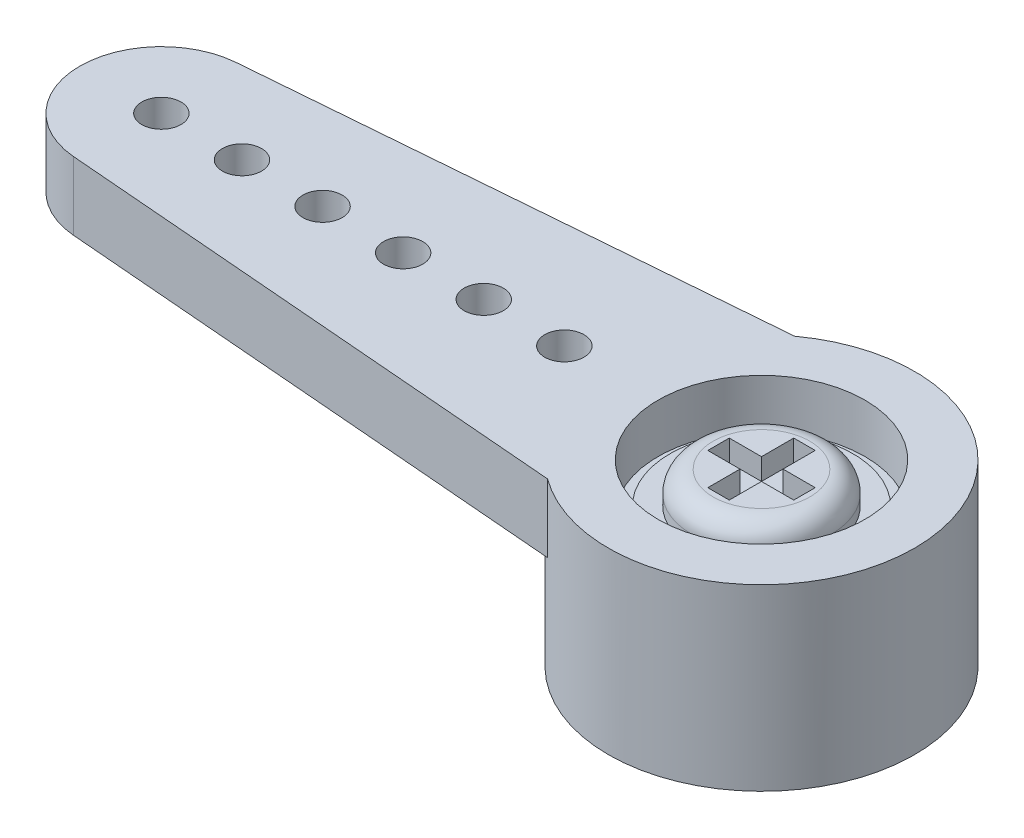
ISO-10303-21;
HEADER;
FILE_DESCRIPTION(('STEP AP214'),'2;1');
FILE_NAME('part.step','',(''),(''),'','','');
FILE_SCHEMA(('AUTOMOTIVE_DESIGN { 1 0 10303 214 1 1 1 1 }'));
ENDSEC;
DATA;
#1=APPLICATION_CONTEXT('core data for automotive mechanical design processes');
#2=APPLICATION_PROTOCOL_DEFINITION('international standard','automotive_design',2000,#1);
#3=PRODUCT_CONTEXT('',#1,'mechanical');
#4=PRODUCT('Part','Part','',(#3));
#5=PRODUCT_RELATED_PRODUCT_CATEGORY('part','',(#4));
#6=PRODUCT_DEFINITION_FORMATION('','',#4);
#7=PRODUCT_DEFINITION_CONTEXT('part definition',#1,'design');
#8=PRODUCT_DEFINITION('design','',#6,#7);
#9=PRODUCT_DEFINITION_SHAPE('','',#8);
#10=(LENGTH_UNIT() NAMED_UNIT(*) SI_UNIT(.MILLI.,.METRE.));
#11=(NAMED_UNIT(*) PLANE_ANGLE_UNIT() SI_UNIT($,.RADIAN.));
#12=(NAMED_UNIT(*) SI_UNIT($,.STERADIAN.) SOLID_ANGLE_UNIT());
#13=UNCERTAINTY_MEASURE_WITH_UNIT(LENGTH_MEASURE(1.E-05),#10,'distance_accuracy_value','');
#14=(GEOMETRIC_REPRESENTATION_CONTEXT(3) GLOBAL_UNCERTAINTY_ASSIGNED_CONTEXT((#13)) GLOBAL_UNIT_ASSIGNED_CONTEXT((#10,
#11,#12)) REPRESENTATION_CONTEXT('',''));
#15=CARTESIAN_POINT('',(0.,0.,0.));
#16=DIRECTION('',(0.,0.,1.));
#17=DIRECTION('',(1.,0.,0.));
#18=AXIS2_PLACEMENT_3D('',#15,#16,#17);
#19=CARTESIAN_POINT('',(0.,0.6604,0.));
#20=DIRECTION('',(0.,1.,0.));
#21=DIRECTION('',(0.,0.,1.));
#22=AXIS2_PLACEMENT_3D('',#19,#20,#21);
#23=PLANE('',#22);
#24=CARTESIAN_POINT('',(0.,0.6604,0.));
#25=DIRECTION('',(0.,1.,0.));
#26=DIRECTION('',(0.,0.,1.));
#27=AXIS2_PLACEMENT_3D('',#24,#25,#26);
#28=CIRCLE('',#27,2.159);
#29=CARTESIAN_POINT('',(0.,0.6604,2.159));
#30=VERTEX_POINT('',#29);
#31=EDGE_CURVE('E265',#30,#30,#28,.T.);
#32=ORIENTED_EDGE('',*,*,#31,.T.);
#33=EDGE_LOOP('',(#32));
#34=FACE_BOUND('',#33,.T.);
#35=CARTESIAN_POINT('',(0.,0.6604,0.));
#36=DIRECTION('',(0.,1.,0.));
#37=DIRECTION('',(0.,0.,1.));
#38=AXIS2_PLACEMENT_3D('',#35,#36,#37);
#39=CIRCLE('',#38,1.651);
#40=CARTESIAN_POINT('',(0.,0.6604,-1.651));
#41=VERTEX_POINT('',#40);
#42=EDGE_CURVE('E242',#41,#41,#39,.T.);
#43=ORIENTED_EDGE('',*,*,#42,.F.);
#44=EDGE_LOOP('',(#43));
#45=FACE_BOUND('',#44,.T.);
#46=ADVANCED_FACE('F35',(#34,#45),#23,.T.);
#47=CARTESIAN_POINT('',(0.,0.4572,0.));
#48=DIRECTION('',(0.,1.,0.));
#49=DIRECTION('',(0.,0.,1.));
#50=AXIS2_PLACEMENT_3D('',#47,#48,#49);
#51=PLANE('',#50);
#52=CARTESIAN_POINT('',(0.,0.4572,0.));
#53=DIRECTION('',(0.,1.,0.));
#54=DIRECTION('',(0.,0.,1.));
#55=AXIS2_PLACEMENT_3D('',#52,#53,#54);
#56=CIRCLE('',#55,2.44475);
#57=CARTESIAN_POINT('',(0.,0.4572,2.44475));
#58=VERTEX_POINT('',#57);
#59=EDGE_CURVE('E277',#58,#58,#56,.T.);
#60=ORIENTED_EDGE('',*,*,#59,.T.);
#61=EDGE_LOOP('',(#60));
#62=FACE_BOUND('',#61,.T.);
#63=CARTESIAN_POINT('',(0.,0.4572,0.));
#64=DIRECTION('',(0.,1.,0.));
#65=DIRECTION('',(0.,0.,1.));
#66=AXIS2_PLACEMENT_3D('',#63,#64,#65);
#67=CIRCLE('',#66,2.159);
#68=CARTESIAN_POINT('',(0.,0.4572,2.159));
#69=VERTEX_POINT('',#68);
#70=EDGE_CURVE('E264',#69,#69,#67,.T.);
#71=ORIENTED_EDGE('',*,*,#70,.F.);
#72=EDGE_LOOP('',(#71));
#73=FACE_BOUND('',#72,.T.);
#74=ADVANCED_FACE('F363',(#62,#73),#51,.T.);
#75=CARTESIAN_POINT('',(0.,-2.6162,0.));
#76=DIRECTION('',(0.,1.,0.));
#77=DIRECTION('',(0.,0.,1.));
#78=AXIS2_PLACEMENT_3D('',#75,#76,#77);
#79=CYLINDRICAL_SURFACE('',#78,1.27);
#80=CARTESIAN_POINT('',(0.,0.4572,0.));
#81=DIRECTION('',(0.,1.,0.));
#82=DIRECTION('',(0.,0.,1.));
#83=AXIS2_PLACEMENT_3D('',#80,#81,#82);
#84=CIRCLE('',#83,1.27);
#85=CARTESIAN_POINT('',(0.,0.4572,1.27));
#86=VERTEX_POINT('',#85);
#87=EDGE_CURVE('E280',#86,#86,#84,.F.);
#88=ORIENTED_EDGE('',*,*,#87,.F.);
#89=EDGE_LOOP('',(#88));
#90=FACE_BOUND('',#89,.T.);
#91=CARTESIAN_POINT('',(0.,-0.2794,0.));
#92=DIRECTION('',(0.,-1.,0.));
#93=DIRECTION('',(0.,0.,-1.));
#94=AXIS2_PLACEMENT_3D('',#91,#92,#93);
#95=CIRCLE('',#94,1.27);
#96=CARTESIAN_POINT('',(0.,-0.2794,-1.27));
#97=VERTEX_POINT('',#96);
#98=EDGE_CURVE('E274',#97,#97,#95,.F.);
#99=ORIENTED_EDGE('',*,*,#98,.F.);
#100=EDGE_LOOP('',(#99));
#101=FACE_BOUND('',#100,.T.);
#102=ADVANCED_FACE('F369',(#90,#101),#79,.F.);
#103=CARTESIAN_POINT('',(0.,1.6129,0.));
#104=DIRECTION('',(0.,-1.,0.));
#105=DIRECTION('',(0.,0.,-1.));
#106=AXIS2_PLACEMENT_3D('',#103,#104,#105);
#107=CYLINDRICAL_SURFACE('',#106,3.6195);
#108=DIRECTION('',(0.,-1.,0.));
#109=VECTOR('',#108,1.);
#110=CARTESIAN_POINT('',(-2.13741415032277,1.6129,2.921));
#111=LINE('',#110,#109);
#112=CARTESIAN_POINT('',(-2.13741415032277,1.6129,2.921));
#113=VERTEX_POINT('',#112);
#114=CARTESIAN_POINT('',(-2.13741415032277,0.,2.921));
#115=VERTEX_POINT('',#114);
#116=EDGE_CURVE('E319',#113,#115,#111,.T.);
#117=ORIENTED_EDGE('',*,*,#116,.T.);
#118=CARTESIAN_POINT('',(0.,0.,0.));
#119=DIRECTION('',(0.,1.,0.));
#120=DIRECTION('',(0.,0.,1.));
#121=AXIS2_PLACEMENT_3D('',#118,#119,#120);
#122=CIRCLE('',#121,3.6195);
#123=CARTESIAN_POINT('',(-2.13741415032277,0.,-2.921));
#124=VERTEX_POINT('',#123);
#125=EDGE_CURVE('E332',#124,#115,#122,.T.);
#126=ORIENTED_EDGE('',*,*,#125,.F.);
#127=DIRECTION('',(0.,-1.,0.));
#128=VECTOR('',#127,1.);
#129=CARTESIAN_POINT('',(-2.13741415032277,1.6129,-2.921));
#130=LINE('',#129,#128);
#131=CARTESIAN_POINT('',(-2.13741415032277,1.6129,-2.921));
#132=VERTEX_POINT('',#131);
#133=EDGE_CURVE('E330',#132,#124,#130,.T.);
#134=ORIENTED_EDGE('',*,*,#133,.F.);
#135=CARTESIAN_POINT('',(0.,1.6129,0.));
#136=DIRECTION('',(0.,1.,0.));
#137=DIRECTION('',(0.,0.,1.));
#138=AXIS2_PLACEMENT_3D('',#135,#136,#137);
#139=CIRCLE('',#138,3.6195);
#140=EDGE_CURVE('E312',#113,#132,#139,.T.);
#141=ORIENTED_EDGE('',*,*,#140,.F.);
#142=EDGE_LOOP('',(#117,#126,#134,#141));
#143=FACE_BOUND('',#142,.T.);
#144=CARTESIAN_POINT('',(0.,-2.6162,0.));
#145=DIRECTION('',(0.,1.,0.));
#146=DIRECTION('',(0.,0.,1.));
#147=AXIS2_PLACEMENT_3D('',#144,#145,#146);
#148=CIRCLE('',#147,3.6195);
#149=CARTESIAN_POINT('',(0.,-2.6162,3.6195));
#150=VERTEX_POINT('',#149);
#151=EDGE_CURVE('E308',#150,#150,#148,.T.);
#152=ORIENTED_EDGE('',*,*,#151,.T.);
#153=EDGE_LOOP('',(#152));
#154=FACE_BOUND('',#153,.T.);
#155=ADVANCED_FACE('F420',(#143,#154),#107,.T.);
#156=CARTESIAN_POINT('',(-14.3430596900559,1.6129,-1.92399194172469));
#157=DIRECTION('',(0.0814130180562945,0.,0.996680450541178));
#158=DIRECTION('',(0.996680450541178,0.,-0.0814130180562945));
#159=AXIS2_PLACEMENT_3D('',#156,#157,#158);
#160=PLANE('',#159);
#161=DIRECTION('',(-0.996680450541178,0.,0.0814130180562945));
#162=VECTOR('',#161,1.);
#163=CARTESIAN_POINT('',(-14.3430596900559,0.,-1.92399194172469));
#164=LINE('',#163,#162);
#165=CARTESIAN_POINT('',(-14.3430596900559,0.,-1.92399194172469));
#166=VERTEX_POINT('',#165);
#167=EDGE_CURVE('E311',#124,#166,#164,.T.);
#168=ORIENTED_EDGE('',*,*,#167,.T.);
#169=DIRECTION('',(0.,-1.,0.));
#170=VECTOR('',#169,1.);
#171=CARTESIAN_POINT('',(-14.3430596900559,1.6129,-1.92399194172469));
#172=LINE('',#171,#170);
#173=CARTESIAN_POINT('',(-14.3430596900559,1.6129,-1.92399194172469));
#174=VERTEX_POINT('',#173);
#175=EDGE_CURVE('E328',#174,#166,#172,.T.);
#176=ORIENTED_EDGE('',*,*,#175,.F.);
#177=DIRECTION('',(-0.996680450541178,0.,0.0814130180562945));
#178=VECTOR('',#177,1.);
#179=CARTESIAN_POINT('',(-14.3430596900559,1.6129,-1.92399194172469));
#180=LINE('',#179,#178);
#181=EDGE_CURVE('E86',#132,#174,#180,.T.);
#182=ORIENTED_EDGE('',*,*,#181,.F.);
#183=ORIENTED_EDGE('',*,*,#133,.T.);
#184=EDGE_LOOP('',(#168,#176,#182,#183));
#185=FACE_BOUND('',#184,.T.);
#186=ADVANCED_FACE('F444',(#185),#160,.F.);
#187=CARTESIAN_POINT('',(-14.1859,1.6129,0.));
#188=DIRECTION('',(0.,-1.,0.));
#189=DIRECTION('',(0.,0.,-1.));
#190=AXIS2_PLACEMENT_3D('',#187,#188,#189);
#191=CYLINDRICAL_SURFACE('',#190,1.9304);
#192=CARTESIAN_POINT('',(-14.1859,0.,0.));
#193=DIRECTION('',(0.,1.,0.));
#194=DIRECTION('',(0.,0.,1.));
#195=AXIS2_PLACEMENT_3D('',#192,#193,#194);
#196=CIRCLE('',#195,1.9304);
#197=CARTESIAN_POINT('',(-14.3430596900559,0.,1.92399194172469));
#198=VERTEX_POINT('',#197);
#199=EDGE_CURVE('E78',#166,#198,#196,.T.);
#200=ORIENTED_EDGE('',*,*,#199,.T.);
#201=DIRECTION('',(0.,-1.,0.));
#202=VECTOR('',#201,1.);
#203=CARTESIAN_POINT('',(-14.3430596900559,1.6129,1.92399194172469));
#204=LINE('',#203,#202);
#205=CARTESIAN_POINT('',(-14.3430596900559,1.6129,1.92399194172469));
#206=VERTEX_POINT('',#205);
#207=EDGE_CURVE('E326',#206,#198,#204,.T.);
#208=ORIENTED_EDGE('',*,*,#207,.F.);
#209=CARTESIAN_POINT('',(-14.1859,1.6129,0.));
#210=DIRECTION('',(0.,1.,0.));
#211=DIRECTION('',(0.,0.,1.));
#212=AXIS2_PLACEMENT_3D('',#209,#210,#211);
#213=CIRCLE('',#212,1.9304);
#214=EDGE_CURVE('E316',#174,#206,#213,.T.);
#215=ORIENTED_EDGE('',*,*,#214,.F.);
#216=ORIENTED_EDGE('',*,*,#175,.T.);
#217=EDGE_LOOP('',(#200,#208,#215,#216));
#218=FACE_BOUND('',#217,.T.);
#219=ADVANCED_FACE('F440',(#218),#191,.T.);
#220=CARTESIAN_POINT('',(-14.3430596900559,1.6129,1.92399194172469));
#221=DIRECTION('',(0.0814130180562943,0.,-0.996680450541178));
#222=DIRECTION('',(-0.996680450541178,0.,-0.0814130180562943));
#223=AXIS2_PLACEMENT_3D('',#220,#221,#222);
#224=PLANE('',#223);
#225=DIRECTION('',(0.996680450541178,0.,0.0814130180562943));
#226=VECTOR('',#225,1.);
#227=CARTESIAN_POINT('',(-14.3430596900559,0.,1.92399194172469));
#228=LINE('',#227,#226);
#229=EDGE_CURVE('E314',#198,#115,#228,.T.);
#230=ORIENTED_EDGE('',*,*,#229,.T.);
#231=ORIENTED_EDGE('',*,*,#116,.F.);
#232=DIRECTION('',(0.996680450541178,0.,0.0814130180562943));
#233=VECTOR('',#232,1.);
#234=CARTESIAN_POINT('',(-14.3430596900559,1.6129,1.92399194172469));
#235=LINE('',#234,#233);
#236=EDGE_CURVE('E59',#206,#113,#235,.T.);
#237=ORIENTED_EDGE('',*,*,#236,.F.);
#238=ORIENTED_EDGE('',*,*,#207,.T.);
#239=EDGE_LOOP('',(#230,#231,#237,#238));
#240=FACE_BOUND('',#239,.T.);
#241=ADVANCED_FACE('F433',(#240),#224,.F.);
#242=CARTESIAN_POINT('',(0.,1.6129,0.));
#243=DIRECTION('',(0.,1.,0.));
#244=DIRECTION('',(0.,0.,1.));
#245=AXIS2_PLACEMENT_3D('',#242,#243,#244);
#246=PLANE('',#245);
#247=CARTESIAN_POINT('',(0.,1.6129,0.));
#248=DIRECTION('',(0.,1.,0.));
#249=DIRECTION('',(0.,0.,1.));
#250=AXIS2_PLACEMENT_3D('',#247,#248,#249);
#251=CIRCLE('',#250,2.44475);
#252=CARTESIAN_POINT('',(0.,1.6129,2.44475));
#253=VERTEX_POINT('',#252);
#254=EDGE_CURVE('E281',#253,#253,#251,.T.);
#255=ORIENTED_EDGE('',*,*,#254,.F.);
#256=EDGE_LOOP('',(#255));
#257=FACE_BOUND('',#256,.T.);
#258=CARTESIAN_POINT('',(-12.2809,1.6129,0.));
#259=DIRECTION('',(0.,1.,0.));
#260=DIRECTION('',(0.,0.,1.));
#261=AXIS2_PLACEMENT_3D('',#258,#259,#260);
#262=CIRCLE('',#261,0.46355);
#263=CARTESIAN_POINT('',(-12.2809,1.6129,0.46355));
#264=VERTEX_POINT('',#263);
#265=EDGE_CURVE('E284',#264,#264,#262,.T.);
#266=ORIENTED_EDGE('',*,*,#265,.F.);
#267=EDGE_LOOP('',(#266));
#268=FACE_BOUND('',#267,.T.);
#269=CARTESIAN_POINT('',(-10.3759,1.6129,0.));
#270=DIRECTION('',(0.,1.,0.));
#271=DIRECTION('',(0.,0.,1.));
#272=AXIS2_PLACEMENT_3D('',#269,#270,#271);
#273=CIRCLE('',#272,0.46355);
#274=CARTESIAN_POINT('',(-10.3759,1.6129,0.46355));
#275=VERTEX_POINT('',#274);
#276=EDGE_CURVE('E288',#275,#275,#273,.T.);
#277=ORIENTED_EDGE('',*,*,#276,.F.);
#278=EDGE_LOOP('',(#277));
#279=FACE_BOUND('',#278,.T.);
#280=CARTESIAN_POINT('',(-8.4709,1.6129,0.));
#281=DIRECTION('',(0.,1.,0.));
#282=DIRECTION('',(0.,0.,1.));
#283=AXIS2_PLACEMENT_3D('',#280,#281,#282);
#284=CIRCLE('',#283,0.46355);
#285=CARTESIAN_POINT('',(-8.4709,1.6129,0.46355));
#286=VERTEX_POINT('',#285);
#287=EDGE_CURVE('E292',#286,#286,#284,.T.);
#288=ORIENTED_EDGE('',*,*,#287,.F.);
#289=EDGE_LOOP('',(#288));
#290=FACE_BOUND('',#289,.T.);
#291=CARTESIAN_POINT('',(-6.5659,1.6129,0.));
#292=DIRECTION('',(0.,1.,0.));
#293=DIRECTION('',(0.,0.,1.));
#294=AXIS2_PLACEMENT_3D('',#291,#292,#293);
#295=CIRCLE('',#294,0.46355);
#296=CARTESIAN_POINT('',(-6.5659,1.6129,0.46355));
#297=VERTEX_POINT('',#296);
#298=EDGE_CURVE('E296',#297,#297,#295,.T.);
#299=ORIENTED_EDGE('',*,*,#298,.F.);
#300=EDGE_LOOP('',(#299));
#301=FACE_BOUND('',#300,.T.);
#302=CARTESIAN_POINT('',(-4.6609,1.6129,0.));
#303=DIRECTION('',(0.,1.,0.));
#304=DIRECTION('',(0.,0.,1.));
#305=AXIS2_PLACEMENT_3D('',#302,#303,#304);
#306=CIRCLE('',#305,0.46355);
#307=CARTESIAN_POINT('',(-4.6609,1.6129,0.46355));
#308=VERTEX_POINT('',#307);
#309=EDGE_CURVE('E300',#308,#308,#306,.T.);
#310=ORIENTED_EDGE('',*,*,#309,.F.);
#311=EDGE_LOOP('',(#310));
#312=FACE_BOUND('',#311,.T.);
#313=CARTESIAN_POINT('',(-14.1859,1.6129,0.));
#314=DIRECTION('',(0.,1.,0.));
#315=DIRECTION('',(0.,0.,1.));
#316=AXIS2_PLACEMENT_3D('',#313,#314,#315);
#317=CIRCLE('',#316,0.46355);
#318=CARTESIAN_POINT('',(-14.1859,1.6129,0.463550000000002));
#319=VERTEX_POINT('',#318);
#320=EDGE_CURVE('E304',#319,#319,#317,.T.);
#321=ORIENTED_EDGE('',*,*,#320,.F.);
#322=EDGE_LOOP('',(#321));
#323=FACE_BOUND('',#322,.T.);
#324=ORIENTED_EDGE('',*,*,#236,.T.);
#325=ORIENTED_EDGE('',*,*,#140,.T.);
#326=ORIENTED_EDGE('',*,*,#181,.T.);
#327=ORIENTED_EDGE('',*,*,#214,.T.);
#328=EDGE_LOOP('',(#324,#325,#326,#327));
#329=FACE_BOUND('',#328,.T.);
#330=ADVANCED_FACE('F430',(#257,#268,#279,#290,#301,#312,#323,#329),#246,.T.);
#331=CARTESIAN_POINT('',(0.,0.,0.));
#332=DIRECTION('',(0.,1.,0.));
#333=DIRECTION('',(0.,0.,1.));
#334=AXIS2_PLACEMENT_3D('',#331,#332,#333);
#335=PLANE('',#334);
#336=CARTESIAN_POINT('',(-12.2809,0.,0.));
#337=DIRECTION('',(0.,1.,0.));
#338=DIRECTION('',(0.,0.,1.));
#339=AXIS2_PLACEMENT_3D('',#336,#337,#338);
#340=CIRCLE('',#339,0.46355);
#341=CARTESIAN_POINT('',(-12.2809,0.,0.46355));
#342=VERTEX_POINT('',#341);
#343=EDGE_CURVE('E287',#342,#342,#340,.T.);
#344=ORIENTED_EDGE('',*,*,#343,.T.);
#345=EDGE_LOOP('',(#344));
#346=FACE_BOUND('',#345,.T.);
#347=CARTESIAN_POINT('',(-10.3759,0.,0.));
#348=DIRECTION('',(0.,1.,0.));
#349=DIRECTION('',(0.,0.,1.));
#350=AXIS2_PLACEMENT_3D('',#347,#348,#349);
#351=CIRCLE('',#350,0.46355);
#352=CARTESIAN_POINT('',(-10.3759,0.,0.46355));
#353=VERTEX_POINT('',#352);
#354=EDGE_CURVE('E291',#353,#353,#351,.T.);
#355=ORIENTED_EDGE('',*,*,#354,.T.);
#356=EDGE_LOOP('',(#355));
#357=FACE_BOUND('',#356,.T.);
#358=CARTESIAN_POINT('',(-8.4709,0.,0.));
#359=DIRECTION('',(0.,1.,0.));
#360=DIRECTION('',(0.,0.,1.));
#361=AXIS2_PLACEMENT_3D('',#358,#359,#360);
#362=CIRCLE('',#361,0.46355);
#363=CARTESIAN_POINT('',(-8.4709,0.,0.46355));
#364=VERTEX_POINT('',#363);
#365=EDGE_CURVE('E295',#364,#364,#362,.T.);
#366=ORIENTED_EDGE('',*,*,#365,.T.);
#367=EDGE_LOOP('',(#366));
#368=FACE_BOUND('',#367,.T.);
#369=CARTESIAN_POINT('',(-6.5659,0.,0.));
#370=DIRECTION('',(0.,1.,0.));
#371=DIRECTION('',(0.,0.,1.));
#372=AXIS2_PLACEMENT_3D('',#369,#370,#371);
#373=CIRCLE('',#372,0.46355);
#374=CARTESIAN_POINT('',(-6.5659,0.,0.46355));
#375=VERTEX_POINT('',#374);
#376=EDGE_CURVE('E299',#375,#375,#373,.T.);
#377=ORIENTED_EDGE('',*,*,#376,.T.);
#378=EDGE_LOOP('',(#377));
#379=FACE_BOUND('',#378,.T.);
#380=CARTESIAN_POINT('',(-4.6609,0.,0.));
#381=DIRECTION('',(0.,1.,0.));
#382=DIRECTION('',(0.,0.,1.));
#383=AXIS2_PLACEMENT_3D('',#380,#381,#382);
#384=CIRCLE('',#383,0.46355);
#385=CARTESIAN_POINT('',(-4.6609,0.,0.46355));
#386=VERTEX_POINT('',#385);
#387=EDGE_CURVE('E303',#386,#386,#384,.T.);
#388=ORIENTED_EDGE('',*,*,#387,.T.);
#389=EDGE_LOOP('',(#388));
#390=FACE_BOUND('',#389,.T.);
#391=CARTESIAN_POINT('',(-14.1859,0.,0.));
#392=DIRECTION('',(0.,1.,0.));
#393=DIRECTION('',(0.,0.,1.));
#394=AXIS2_PLACEMENT_3D('',#391,#392,#393);
#395=CIRCLE('',#394,0.46355);
#396=CARTESIAN_POINT('',(-14.1859,0.,0.463550000000002));
#397=VERTEX_POINT('',#396);
#398=EDGE_CURVE('E307',#397,#397,#395,.T.);
#399=ORIENTED_EDGE('',*,*,#398,.T.);
#400=EDGE_LOOP('',(#399));
#401=FACE_BOUND('',#400,.T.);
#402=ORIENTED_EDGE('',*,*,#167,.F.);
#403=ORIENTED_EDGE('',*,*,#125,.T.);
#404=ORIENTED_EDGE('',*,*,#229,.F.);
#405=ORIENTED_EDGE('',*,*,#199,.F.);
#406=EDGE_LOOP('',(#402,#403,#404,#405));
#407=FACE_BOUND('',#406,.T.);
#408=ADVANCED_FACE('F428',(#346,#357,#368,#379,#390,#401,#407),#335,.F.);
#409=CARTESIAN_POINT('',(0.,-2.6162,0.));
#410=DIRECTION('',(0.,1.,0.));
#411=DIRECTION('',(0.,0.,1.));
#412=AXIS2_PLACEMENT_3D('',#409,#410,#411);
#413=PLANE('',#412);
#414=CARTESIAN_POINT('',(0.,-2.6162,0.));
#415=DIRECTION('',(0.,-1.,0.));
#416=DIRECTION('',(0.,0.,-1.));
#417=AXIS2_PLACEMENT_3D('',#414,#415,#416);
#418=CIRCLE('',#417,2.286);
#419=CARTESIAN_POINT('',(0.,-2.6162,-2.286));
#420=VERTEX_POINT('',#419);
#421=EDGE_CURVE('E268',#420,#420,#418,.T.);
#422=ORIENTED_EDGE('',*,*,#421,.F.);
#423=EDGE_LOOP('',(#422));
#424=FACE_BOUND('',#423,.T.);
#425=ORIENTED_EDGE('',*,*,#151,.F.);
#426=EDGE_LOOP('',(#425));
#427=FACE_BOUND('',#426,.T.);
#428=ADVANCED_FACE('F424',(#424,#427),#413,.F.);
#429=CARTESIAN_POINT('',(-14.1859,-2.6162,0.));
#430=DIRECTION('',(0.,1.,0.));
#431=DIRECTION('',(0.,0.,1.));
#432=AXIS2_PLACEMENT_3D('',#429,#430,#431);
#433=CYLINDRICAL_SURFACE('',#432,0.46355);
#434=ORIENTED_EDGE('',*,*,#320,.T.);
#435=EDGE_LOOP('',(#434));
#436=FACE_BOUND('',#435,.T.);
#437=ORIENTED_EDGE('',*,*,#398,.F.);
#438=EDGE_LOOP('',(#437));
#439=FACE_BOUND('',#438,.T.);
#440=ADVANCED_FACE('F416',(#436,#439),#433,.F.);
#441=CARTESIAN_POINT('',(-4.6609,-2.6162,0.));
#442=DIRECTION('',(0.,1.,0.));
#443=DIRECTION('',(0.,0.,1.));
#444=AXIS2_PLACEMENT_3D('',#441,#442,#443);
#445=CYLINDRICAL_SURFACE('',#444,0.46355);
#446=ORIENTED_EDGE('',*,*,#309,.T.);
#447=EDGE_LOOP('',(#446));
#448=FACE_BOUND('',#447,.T.);
#449=ORIENTED_EDGE('',*,*,#387,.F.);
#450=EDGE_LOOP('',(#449));
#451=FACE_BOUND('',#450,.T.);
#452=ADVANCED_FACE('F412',(#448,#451),#445,.F.);
#453=CARTESIAN_POINT('',(-6.5659,-2.6162,0.));
#454=DIRECTION('',(0.,1.,0.));
#455=DIRECTION('',(0.,0.,1.));
#456=AXIS2_PLACEMENT_3D('',#453,#454,#455);
#457=CYLINDRICAL_SURFACE('',#456,0.46355);
#458=ORIENTED_EDGE('',*,*,#298,.T.);
#459=EDGE_LOOP('',(#458));
#460=FACE_BOUND('',#459,.T.);
#461=ORIENTED_EDGE('',*,*,#376,.F.);
#462=EDGE_LOOP('',(#461));
#463=FACE_BOUND('',#462,.T.);
#464=ADVANCED_FACE('F408',(#460,#463),#457,.F.);
#465=CARTESIAN_POINT('',(-8.4709,-2.6162,0.));
#466=DIRECTION('',(0.,1.,0.));
#467=DIRECTION('',(0.,0.,1.));
#468=AXIS2_PLACEMENT_3D('',#465,#466,#467);
#469=CYLINDRICAL_SURFACE('',#468,0.46355);
#470=ORIENTED_EDGE('',*,*,#287,.T.);
#471=EDGE_LOOP('',(#470));
#472=FACE_BOUND('',#471,.T.);
#473=ORIENTED_EDGE('',*,*,#365,.F.);
#474=EDGE_LOOP('',(#473));
#475=FACE_BOUND('',#474,.T.);
#476=ADVANCED_FACE('F404',(#472,#475),#469,.F.);
#477=CARTESIAN_POINT('',(-10.3759,-2.6162,0.));
#478=DIRECTION('',(0.,1.,0.));
#479=DIRECTION('',(0.,0.,1.));
#480=AXIS2_PLACEMENT_3D('',#477,#478,#479);
#481=CYLINDRICAL_SURFACE('',#480,0.46355);
#482=ORIENTED_EDGE('',*,*,#276,.T.);
#483=EDGE_LOOP('',(#482));
#484=FACE_BOUND('',#483,.T.);
#485=ORIENTED_EDGE('',*,*,#354,.F.);
#486=EDGE_LOOP('',(#485));
#487=FACE_BOUND('',#486,.T.);
#488=ADVANCED_FACE('F400',(#484,#487),#481,.F.);
#489=CARTESIAN_POINT('',(-12.2809,-2.6162,0.));
#490=DIRECTION('',(0.,1.,0.));
#491=DIRECTION('',(0.,0.,1.));
#492=AXIS2_PLACEMENT_3D('',#489,#490,#491);
#493=CYLINDRICAL_SURFACE('',#492,0.46355);
#494=ORIENTED_EDGE('',*,*,#265,.T.);
#495=EDGE_LOOP('',(#494));
#496=FACE_BOUND('',#495,.T.);
#497=ORIENTED_EDGE('',*,*,#343,.F.);
#498=EDGE_LOOP('',(#497));
#499=FACE_BOUND('',#498,.T.);
#500=ADVANCED_FACE('F396',(#496,#499),#493,.F.);
#501=CARTESIAN_POINT('',(0.,0.4572,0.));
#502=DIRECTION('',(0.,1.,0.));
#503=DIRECTION('',(0.,0.,1.));
#504=AXIS2_PLACEMENT_3D('',#501,#502,#503);
#505=CYLINDRICAL_SURFACE('',#504,2.44475);
#506=ORIENTED_EDGE('',*,*,#59,.F.);
#507=EDGE_LOOP('',(#506));
#508=FACE_BOUND('',#507,.T.);
#509=ORIENTED_EDGE('',*,*,#254,.T.);
#510=EDGE_LOOP('',(#509));
#511=FACE_BOUND('',#510,.T.);
#512=ADVANCED_FACE('F389',(#508,#511),#505,.F.);
#513=CARTESIAN_POINT('',(0.,-0.2794,0.));
#514=DIRECTION('',(0.,-1.,0.));
#515=DIRECTION('',(0.,0.,-1.));
#516=AXIS2_PLACEMENT_3D('',#513,#514,#515);
#517=PLANE('',#516);
#518=CARTESIAN_POINT('',(0.,-0.2794,0.));
#519=DIRECTION('',(0.,-1.,0.));
#520=DIRECTION('',(0.,0.,-1.));
#521=AXIS2_PLACEMENT_3D('',#518,#519,#520);
#522=CIRCLE('',#521,2.286);
#523=CARTESIAN_POINT('',(0.,-0.2794,-2.286));
#524=VERTEX_POINT('',#523);
#525=EDGE_CURVE('E271',#524,#524,#522,.T.);
#526=ORIENTED_EDGE('',*,*,#525,.T.);
#527=EDGE_LOOP('',(#526));
#528=FACE_BOUND('',#527,.T.);
#529=ORIENTED_EDGE('',*,*,#98,.T.);
#530=EDGE_LOOP('',(#529));
#531=FACE_BOUND('',#530,.T.);
#532=ADVANCED_FACE('F386',(#528,#531),#517,.T.);
#533=CARTESIAN_POINT('',(0.,-0.2794,0.));
#534=DIRECTION('',(0.,-1.,0.));
#535=DIRECTION('',(0.,0.,-1.));
#536=AXIS2_PLACEMENT_3D('',#533,#534,#535);
#537=CYLINDRICAL_SURFACE('',#536,2.286);
#538=ORIENTED_EDGE('',*,*,#525,.F.);
#539=EDGE_LOOP('',(#538));
#540=FACE_BOUND('',#539,.T.);
#541=ORIENTED_EDGE('',*,*,#421,.T.);
#542=EDGE_LOOP('',(#541));
#543=FACE_BOUND('',#542,.T.);
#544=ADVANCED_FACE('F384',(#540,#543),#537,.F.);
#545=CARTESIAN_POINT('',(0.,0.6604,0.));
#546=DIRECTION('',(0.,-1.,0.));
#547=DIRECTION('',(0.,0.,-1.));
#548=AXIS2_PLACEMENT_3D('',#545,#546,#547);
#549=CYLINDRICAL_SURFACE('',#548,2.159);
#550=ORIENTED_EDGE('',*,*,#31,.F.);
#551=EDGE_LOOP('',(#550));
#552=FACE_BOUND('',#551,.T.);
#553=ORIENTED_EDGE('',*,*,#70,.T.);
#554=EDGE_LOOP('',(#553));
#555=FACE_BOUND('',#554,.T.);
#556=ADVANCED_FACE('F380',(#552,#555),#549,.T.);
#557=CARTESIAN_POINT('',(0.,0.4572,0.));
#558=DIRECTION('',(0.,1.,0.));
#559=DIRECTION('',(0.,0.,1.));
#560=AXIS2_PLACEMENT_3D('',#557,#558,#559);
#561=PLANE('',#560);
#562=ORIENTED_EDGE('',*,*,#87,.T.);
#563=EDGE_LOOP('',(#562));
#564=FACE_BOUND('',#563,.T.);
#565=ADVANCED_FACE('F377',(#564),#561,.F.);
#566=CARTESIAN_POINT('',(0.,1.4224,0.));
#567=DIRECTION('',(0.,-1.,0.));
#568=DIRECTION('',(0.,0.,-1.));
#569=AXIS2_PLACEMENT_3D('',#566,#567,#568);
#570=CYLINDRICAL_SURFACE('',#569,1.651);
#571=CARTESIAN_POINT('',(0.,0.9144,0.));
#572=DIRECTION('',(0.,1.,0.));
#573=DIRECTION('',(0.,0.,1.));
#574=AXIS2_PLACEMENT_3D('',#571,#572,#573);
#575=CIRCLE('',#574,1.651);
#576=CARTESIAN_POINT('',(0.,0.9144,-1.651));
#577=VERTEX_POINT('',#576);
#578=EDGE_CURVE('E11',#577,#577,#575,.F.);
#579=CARTESIAN_POINT('',(0.,0.9144,-1.651));
#580=CARTESIAN_POINT('',(0.,0.911754166666666,-1.651));
#581=CARTESIAN_POINT('',(0.,0.909108333333333,-1.651));
#582=CARTESIAN_POINT('',(0.,0.903816666666666,-1.651));
#583=CARTESIAN_POINT('',(0.,0.901170833333333,-1.651));
#584=CARTESIAN_POINT('',(0.,0.895879166666666,-1.651));
#585=CARTESIAN_POINT('',(0.,0.893233333333333,-1.651));
#586=CARTESIAN_POINT('',(0.,0.887941666666667,-1.651));
#587=CARTESIAN_POINT('',(0.,0.885295833333333,-1.651));
#588=CARTESIAN_POINT('',(0.,0.880004166666666,-1.651));
#589=CARTESIAN_POINT('',(0.,0.877358333333333,-1.651));
#590=CARTESIAN_POINT('',(0.,0.872066666666666,-1.651));
#591=CARTESIAN_POINT('',(0.,0.869420833333333,-1.651));
#592=CARTESIAN_POINT('',(0.,0.864129166666667,-1.651));
#593=CARTESIAN_POINT('',(0.,0.861483333333333,-1.651));
#594=CARTESIAN_POINT('',(0.,0.856191666666666,-1.651));
#595=CARTESIAN_POINT('',(0.,0.853545833333333,-1.651));
#596=CARTESIAN_POINT('',(0.,0.848254166666666,-1.651));
#597=CARTESIAN_POINT('',(0.,0.845608333333333,-1.651));
#598=CARTESIAN_POINT('',(0.,0.840316666666666,-1.651));
#599=CARTESIAN_POINT('',(0.,0.837670833333333,-1.651));
#600=CARTESIAN_POINT('',(0.,0.832379166666666,-1.651));
#601=CARTESIAN_POINT('',(0.,0.829733333333333,-1.651));
#602=CARTESIAN_POINT('',(0.,0.824441666666667,-1.651));
#603=CARTESIAN_POINT('',(0.,0.821795833333333,-1.651));
#604=CARTESIAN_POINT('',(0.,0.816504166666666,-1.651));
#605=CARTESIAN_POINT('',(0.,0.813858333333333,-1.651));
#606=CARTESIAN_POINT('',(0.,0.808566666666666,-1.651));
#607=CARTESIAN_POINT('',(0.,0.805920833333333,-1.651));
#608=CARTESIAN_POINT('',(0.,0.800629166666667,-1.651));
#609=CARTESIAN_POINT('',(0.,0.797983333333333,-1.651));
#610=CARTESIAN_POINT('',(0.,0.792691666666667,-1.651));
#611=CARTESIAN_POINT('',(0.,0.790045833333333,-1.651));
#612=CARTESIAN_POINT('',(0.,0.784754166666667,-1.651));
#613=CARTESIAN_POINT('',(0.,0.782108333333333,-1.651));
#614=CARTESIAN_POINT('',(0.,0.776816666666666,-1.651));
#615=CARTESIAN_POINT('',(0.,0.774170833333333,-1.651));
#616=CARTESIAN_POINT('',(0.,0.768879166666666,-1.651));
#617=CARTESIAN_POINT('',(0.,0.766233333333333,-1.651));
#618=CARTESIAN_POINT('',(0.,0.760941666666667,-1.651));
#619=CARTESIAN_POINT('',(0.,0.758295833333333,-1.651));
#620=CARTESIAN_POINT('',(0.,0.753004166666666,-1.651));
#621=CARTESIAN_POINT('',(0.,0.750358333333333,-1.651));
#622=CARTESIAN_POINT('',(0.,0.745066666666667,-1.651));
#623=CARTESIAN_POINT('',(0.,0.742420833333333,-1.651));
#624=CARTESIAN_POINT('',(0.,0.737129166666667,-1.651));
#625=CARTESIAN_POINT('',(0.,0.734483333333333,-1.651));
#626=CARTESIAN_POINT('',(0.,0.729191666666667,-1.651));
#627=CARTESIAN_POINT('',(0.,0.726545833333333,-1.651));
#628=CARTESIAN_POINT('',(0.,0.721254166666667,-1.651));
#629=CARTESIAN_POINT('',(0.,0.718608333333333,-1.651));
#630=CARTESIAN_POINT('',(0.,0.713316666666666,-1.651));
#631=CARTESIAN_POINT('',(0.,0.710670833333333,-1.651));
#632=CARTESIAN_POINT('',(0.,0.705379166666666,-1.651));
#633=CARTESIAN_POINT('',(0.,0.702733333333333,-1.651));
#634=CARTESIAN_POINT('',(0.,0.697441666666667,-1.651));
#635=CARTESIAN_POINT('',(0.,0.694795833333333,-1.651));
#636=CARTESIAN_POINT('',(0.,0.689504166666667,-1.651));
#637=CARTESIAN_POINT('',(0.,0.686858333333333,-1.651));
#638=CARTESIAN_POINT('',(0.,0.681566666666667,-1.651));
#639=CARTESIAN_POINT('',(0.,0.678920833333333,-1.651));
#640=CARTESIAN_POINT('',(0.,0.673629166666667,-1.651));
#641=CARTESIAN_POINT('',(0.,0.670983333333333,-1.651));
#642=CARTESIAN_POINT('',(0.,0.665691666666667,-1.651));
#643=CARTESIAN_POINT('',(0.,0.663045833333333,-1.651));
#644=CARTESIAN_POINT('',(0.,0.6604,-1.651));
#645=B_SPLINE_CURVE_WITH_KNOTS('',3,(#579,#580,#581,#582,#583,#584,#585,#586,#587,#588,#589,
#590,#591,#592,#593,#594,#595,#596,#597,#598,#599,#600,#601,#602,#603,#604,#605,#606,#607,#608,
#609,#610,#611,#612,#613,#614,#615,#616,#617,#618,#619,#620,#621,#622,#623,#624,#625,#626,#627,
#628,#629,#630,#631,#632,#633,#634,#635,#636,#637,#638,#639,#640,#641,#642,#643,#644),
.UNSPECIFIED.,.F.,.F.,(4,2,2,2,2,2,2,2,2,2,2,2,2,2,2,2,2,2,2,2,2,2,2,2,2,2,2,2,2,2,2,2,4),(0.,
0.00793750000000002,0.015875,0.0238125,0.03175,0.0396875,0.0476249999999999,0.0555624999999999,
0.0635,0.0714375,0.079375,0.0873124999999999,0.09525,0.1031875,0.111125,0.1190625,0.127,
0.1349375,0.142875,0.1508125,0.15875,0.1666875,0.174625,0.1825625,0.1905,0.1984375,0.206375,
0.2143125,0.22225,0.2301875,0.238125,0.2460625,0.254),.UNSPECIFIED.);
#646=EDGE_CURVE('BSEAM375',#577,#41,#645,.T.);
#647=ORIENTED_EDGE('',*,*,#578,.T.);
#648=ORIENTED_EDGE('',*,*,#42,.T.);
#649=ORIENTED_EDGE('',*,*,#646,.T.);
#650=ORIENTED_EDGE('',*,*,#646,.F.);
#651=EDGE_LOOP('',(#647,#649,#648,#650));
#652=FACE_BOUND('',#651,.T.);
#653=ADVANCED_FACE('F375',(#652),#570,.T.);
#654=CARTESIAN_POINT('',(0.,1.4224,0.));
#655=DIRECTION('',(0.,1.,0.));
#656=DIRECTION('',(0.,0.,1.));
#657=AXIS2_PLACEMENT_3D('',#654,#655,#656);
#658=PLANE('',#657);
#659=CARTESIAN_POINT('',(0.,1.4224,0.));
#660=DIRECTION('',(0.,1.,0.));
#661=DIRECTION('',(0.,0.,1.));
#662=AXIS2_PLACEMENT_3D('',#659,#660,#661);
#663=CIRCLE('',#662,1.143);
#664=CARTESIAN_POINT('',(0.,1.4224,1.143));
#665=VERTEX_POINT('',#664);
#666=EDGE_CURVE('E43',#665,#665,#663,.T.);
#667=ORIENTED_EDGE('',*,*,#666,.T.);
#668=EDGE_LOOP('',(#667));
#669=FACE_BOUND('',#668,.T.);
#670=DIRECTION('',(1.,0.,0.));
#671=VECTOR('',#670,1.);
#672=CARTESIAN_POINT('',(0.254,1.4224,0.254));
#673=LINE('',#672,#671);
#674=CARTESIAN_POINT('',(0.254,1.4224,0.254));
#675=VERTEX_POINT('',#674);
#676=CARTESIAN_POINT('',(1.016,1.4224,0.254000000000001));
#677=VERTEX_POINT('',#676);
#678=EDGE_CURVE('E50',#675,#677,#673,.T.);
#679=ORIENTED_EDGE('',*,*,#678,.F.);
#680=DIRECTION('',(0.,0.,-1.));
#681=VECTOR('',#680,1.);
#682=CARTESIAN_POINT('',(0.254,1.4224,1.016));
#683=LINE('',#682,#681);
#684=CARTESIAN_POINT('',(0.254,1.4224,1.016));
#685=VERTEX_POINT('',#684);
#686=EDGE_CURVE('E180',#685,#675,#683,.T.);
#687=ORIENTED_EDGE('',*,*,#686,.F.);
#688=DIRECTION('',(1.,0.,0.));
#689=VECTOR('',#688,1.);
#690=CARTESIAN_POINT('',(0.254,1.4224,1.016));
#691=LINE('',#690,#689);
#692=CARTESIAN_POINT('',(-0.254,1.4224,1.016));
#693=VERTEX_POINT('',#692);
#694=EDGE_CURVE('E183',#693,#685,#691,.T.);
#695=ORIENTED_EDGE('',*,*,#694,.F.);
#696=DIRECTION('',(0.,0.,1.));
#697=VECTOR('',#696,1.);
#698=CARTESIAN_POINT('',(-0.254,1.4224,1.016));
#699=LINE('',#698,#697);
#700=CARTESIAN_POINT('',(-0.254,1.4224,0.254));
#701=VERTEX_POINT('',#700);
#702=EDGE_CURVE('E235',#701,#693,#699,.T.);
#703=ORIENTED_EDGE('',*,*,#702,.F.);
#704=DIRECTION('',(1.,0.,0.));
#705=VECTOR('',#704,1.);
#706=CARTESIAN_POINT('',(-0.254,1.4224,0.254));
#707=LINE('',#706,#705);
#708=CARTESIAN_POINT('',(-1.016,1.4224,0.254));
#709=VERTEX_POINT('',#708);
#710=EDGE_CURVE('E232',#709,#701,#707,.T.);
#711=ORIENTED_EDGE('',*,*,#710,.F.);
#712=DIRECTION('',(0.,0.,1.));
#713=VECTOR('',#712,1.);
#714=CARTESIAN_POINT('',(-1.016,1.4224,0.254));
#715=LINE('',#714,#713);
#716=CARTESIAN_POINT('',(-1.016,1.4224,-0.254000000000001));
#717=VERTEX_POINT('',#716);
#718=EDGE_CURVE('E229',#717,#709,#715,.T.);
#719=ORIENTED_EDGE('',*,*,#718,.F.);
#720=DIRECTION('',(-1.,0.,0.));
#721=VECTOR('',#720,1.);
#722=CARTESIAN_POINT('',(-0.254,1.4224,-0.254));
#723=LINE('',#722,#721);
#724=CARTESIAN_POINT('',(-0.254,1.4224,-0.254));
#725=VERTEX_POINT('',#724);
#726=EDGE_CURVE('E226',#725,#717,#723,.T.);
#727=ORIENTED_EDGE('',*,*,#726,.F.);
#728=DIRECTION('',(0.,0.,1.));
#729=VECTOR('',#728,1.);
#730=CARTESIAN_POINT('',(-0.254000000000001,1.4224,-1.016));
#731=LINE('',#730,#729);
#732=CARTESIAN_POINT('',(-0.254000000000001,1.4224,-1.016));
#733=VERTEX_POINT('',#732);
#734=EDGE_CURVE('E223',#733,#725,#731,.T.);
#735=ORIENTED_EDGE('',*,*,#734,.F.);
#736=DIRECTION('',(-1.,0.,0.));
#737=VECTOR('',#736,1.);
#738=CARTESIAN_POINT('',(0.254,1.4224,-1.016));
#739=LINE('',#738,#737);
#740=CARTESIAN_POINT('',(0.254,1.4224,-1.016));
#741=VERTEX_POINT('',#740);
#742=EDGE_CURVE('E220',#741,#733,#739,.T.);
#743=ORIENTED_EDGE('',*,*,#742,.F.);
#744=DIRECTION('',(0.,0.,-1.));
#745=VECTOR('',#744,1.);
#746=CARTESIAN_POINT('',(0.254,1.4224,-1.016));
#747=LINE('',#746,#745);
#748=CARTESIAN_POINT('',(0.254,1.4224,-0.254));
#749=VERTEX_POINT('',#748);
#750=EDGE_CURVE('E217',#749,#741,#747,.T.);
#751=ORIENTED_EDGE('',*,*,#750,.F.);
#752=DIRECTION('',(-1.,0.,0.));
#753=VECTOR('',#752,1.);
#754=CARTESIAN_POINT('',(0.254,1.4224,-0.254));
#755=LINE('',#754,#753);
#756=CARTESIAN_POINT('',(1.016,1.4224,-0.254000000000001));
#757=VERTEX_POINT('',#756);
#758=EDGE_CURVE('E214',#757,#749,#755,.T.);
#759=ORIENTED_EDGE('',*,*,#758,.F.);
#760=DIRECTION('',(0.,0.,-1.));
#761=VECTOR('',#760,1.);
#762=CARTESIAN_POINT('',(1.016,1.4224,0.254000000000001));
#763=LINE('',#762,#761);
#764=EDGE_CURVE('E212',#677,#757,#763,.T.);
#765=ORIENTED_EDGE('',*,*,#764,.F.);
#766=EDGE_LOOP('',(#679,#687,#695,#703,#711,#719,#727,#735,#743,#751,#759,#765));
#767=FACE_BOUND('',#766,.T.);
#768=ADVANCED_FACE('F352',(#669,#767),#658,.T.);
#769=CARTESIAN_POINT('',(0.254,0.9144,0.254));
#770=DIRECTION('',(0.,0.,1.));
#771=DIRECTION('',(1.,0.,0.));
#772=AXIS2_PLACEMENT_3D('',#769,#770,#771);
#773=PLANE('',#772);
#774=ORIENTED_EDGE('',*,*,#678,.T.);
#775=DIRECTION('',(0.,1.,0.));
#776=VECTOR('',#775,1.);
#777=CARTESIAN_POINT('',(1.016,0.9144,0.254000000000001));
#778=LINE('',#777,#776);
#779=CARTESIAN_POINT('',(1.016,0.9144,0.254000000000001));
#780=VERTEX_POINT('',#779);
#781=EDGE_CURVE('E157',#780,#677,#778,.T.);
#782=ORIENTED_EDGE('',*,*,#781,.F.);
#783=DIRECTION('',(1.,0.,0.));
#784=VECTOR('',#783,1.);
#785=CARTESIAN_POINT('',(0.254,0.9144,0.254));
#786=LINE('',#785,#784);
#787=CARTESIAN_POINT('',(0.254,0.9144,0.254));
#788=VERTEX_POINT('',#787);
#789=EDGE_CURVE('E161',#788,#780,#786,.T.);
#790=ORIENTED_EDGE('',*,*,#789,.F.);
#791=DIRECTION('',(0.,1.,0.));
#792=VECTOR('',#791,1.);
#793=CARTESIAN_POINT('',(0.254,0.9144,0.254));
#794=LINE('',#793,#792);
#795=EDGE_CURVE('E240',#788,#675,#794,.T.);
#796=ORIENTED_EDGE('',*,*,#795,.T.);
#797=EDGE_LOOP('',(#774,#782,#790,#796));
#798=FACE_BOUND('',#797,.T.);
#799=ADVANCED_FACE('F159',(#798),#773,.F.);
#800=CARTESIAN_POINT('',(0.254,0.9144,1.016));
#801=DIRECTION('',(1.,0.,0.));
#802=DIRECTION('',(0.,0.,-1.));
#803=AXIS2_PLACEMENT_3D('',#800,#801,#802);
#804=PLANE('',#803);
#805=ORIENTED_EDGE('',*,*,#686,.T.);
#806=ORIENTED_EDGE('',*,*,#795,.F.);
#807=DIRECTION('',(0.,0.,-1.));
#808=VECTOR('',#807,1.);
#809=CARTESIAN_POINT('',(0.254,0.9144,1.016));
#810=LINE('',#809,#808);
#811=CARTESIAN_POINT('',(0.254,0.9144,1.016));
#812=VERTEX_POINT('',#811);
#813=EDGE_CURVE('E167',#812,#788,#810,.T.);
#814=ORIENTED_EDGE('',*,*,#813,.F.);
#815=DIRECTION('',(0.,1.,0.));
#816=VECTOR('',#815,1.);
#817=CARTESIAN_POINT('',(0.254,0.9144,1.016));
#818=LINE('',#817,#816);
#819=EDGE_CURVE('E243',#812,#685,#818,.T.);
#820=ORIENTED_EDGE('',*,*,#819,.T.);
#821=EDGE_LOOP('',(#805,#806,#814,#820));
#822=FACE_BOUND('',#821,.T.);
#823=ADVANCED_FACE('F548',(#822),#804,.F.);
#824=CARTESIAN_POINT('',(0.254,0.9144,1.016));
#825=DIRECTION('',(0.,0.,1.));
#826=DIRECTION('',(1.,0.,0.));
#827=AXIS2_PLACEMENT_3D('',#824,#825,#826);
#828=PLANE('',#827);
#829=ORIENTED_EDGE('',*,*,#694,.T.);
#830=ORIENTED_EDGE('',*,*,#819,.F.);
#831=DIRECTION('',(1.,0.,0.));
#832=VECTOR('',#831,1.);
#833=CARTESIAN_POINT('',(0.254,0.9144,1.016));
#834=LINE('',#833,#832);
#835=CARTESIAN_POINT('',(-0.254,0.9144,1.016));
#836=VERTEX_POINT('',#835);
#837=EDGE_CURVE('E208',#836,#812,#834,.T.);
#838=ORIENTED_EDGE('',*,*,#837,.F.);
#839=DIRECTION('',(0.,1.,0.));
#840=VECTOR('',#839,1.);
#841=CARTESIAN_POINT('',(-0.254,0.9144,1.016));
#842=LINE('',#841,#840);
#843=EDGE_CURVE('E245',#836,#693,#842,.T.);
#844=ORIENTED_EDGE('',*,*,#843,.T.);
#845=EDGE_LOOP('',(#829,#830,#838,#844));
#846=FACE_BOUND('',#845,.T.);
#847=ADVANCED_FACE('F555',(#846),#828,.F.);
#848=CARTESIAN_POINT('',(-0.254,0.9144,1.016));
#849=DIRECTION('',(-1.,0.,0.));
#850=DIRECTION('',(0.,0.,1.));
#851=AXIS2_PLACEMENT_3D('',#848,#849,#850);
#852=PLANE('',#851);
#853=ORIENTED_EDGE('',*,*,#702,.T.);
#854=ORIENTED_EDGE('',*,*,#843,.F.);
#855=DIRECTION('',(0.,0.,1.));
#856=VECTOR('',#855,1.);
#857=CARTESIAN_POINT('',(-0.254,0.9144,1.016));
#858=LINE('',#857,#856);
#859=CARTESIAN_POINT('',(-0.254,0.9144,0.254));
#860=VERTEX_POINT('',#859);
#861=EDGE_CURVE('E205',#860,#836,#858,.T.);
#862=ORIENTED_EDGE('',*,*,#861,.F.);
#863=DIRECTION('',(0.,1.,0.));
#864=VECTOR('',#863,1.);
#865=CARTESIAN_POINT('',(-0.254,0.9144,0.254));
#866=LINE('',#865,#864);
#867=EDGE_CURVE('E247',#860,#701,#866,.T.);
#868=ORIENTED_EDGE('',*,*,#867,.T.);
#869=EDGE_LOOP('',(#853,#854,#862,#868));
#870=FACE_BOUND('',#869,.T.);
#871=ADVANCED_FACE('F563',(#870),#852,.F.);
#872=CARTESIAN_POINT('',(-0.254,0.9144,0.254));
#873=DIRECTION('',(0.,0.,1.));
#874=DIRECTION('',(1.,0.,0.));
#875=AXIS2_PLACEMENT_3D('',#872,#873,#874);
#876=PLANE('',#875);
#877=ORIENTED_EDGE('',*,*,#710,.T.);
#878=ORIENTED_EDGE('',*,*,#867,.F.);
#879=DIRECTION('',(1.,0.,0.));
#880=VECTOR('',#879,1.);
#881=CARTESIAN_POINT('',(-0.254,0.9144,0.254));
#882=LINE('',#881,#880);
#883=CARTESIAN_POINT('',(-1.016,0.9144,0.254));
#884=VERTEX_POINT('',#883);
#885=EDGE_CURVE('E202',#884,#860,#882,.T.);
#886=ORIENTED_EDGE('',*,*,#885,.F.);
#887=DIRECTION('',(0.,1.,0.));
#888=VECTOR('',#887,1.);
#889=CARTESIAN_POINT('',(-1.016,0.9144,0.254));
#890=LINE('',#889,#888);
#891=EDGE_CURVE('E249',#884,#709,#890,.T.);
#892=ORIENTED_EDGE('',*,*,#891,.T.);
#893=EDGE_LOOP('',(#877,#878,#886,#892));
#894=FACE_BOUND('',#893,.T.);
#895=ADVANCED_FACE('F571',(#894),#876,.F.);
#896=CARTESIAN_POINT('',(-1.016,0.9144,0.254));
#897=DIRECTION('',(-1.,0.,0.));
#898=DIRECTION('',(0.,0.,1.));
#899=AXIS2_PLACEMENT_3D('',#896,#897,#898);
#900=PLANE('',#899);
#901=ORIENTED_EDGE('',*,*,#718,.T.);
#902=ORIENTED_EDGE('',*,*,#891,.F.);
#903=DIRECTION('',(0.,0.,1.));
#904=VECTOR('',#903,1.);
#905=CARTESIAN_POINT('',(-1.016,0.9144,0.254));
#906=LINE('',#905,#904);
#907=CARTESIAN_POINT('',(-1.016,0.9144,-0.254000000000001));
#908=VERTEX_POINT('',#907);
#909=EDGE_CURVE('E199',#908,#884,#906,.T.);
#910=ORIENTED_EDGE('',*,*,#909,.F.);
#911=DIRECTION('',(0.,1.,0.));
#912=VECTOR('',#911,1.);
#913=CARTESIAN_POINT('',(-1.016,0.9144,-0.254000000000001));
#914=LINE('',#913,#912);
#915=EDGE_CURVE('E251',#908,#717,#914,.T.);
#916=ORIENTED_EDGE('',*,*,#915,.T.);
#917=EDGE_LOOP('',(#901,#902,#910,#916));
#918=FACE_BOUND('',#917,.T.);
#919=ADVANCED_FACE('F579',(#918),#900,.F.);
#920=CARTESIAN_POINT('',(-0.254,0.9144,-0.254));
#921=DIRECTION('',(0.,0.,-1.));
#922=DIRECTION('',(-1.,0.,0.));
#923=AXIS2_PLACEMENT_3D('',#920,#921,#922);
#924=PLANE('',#923);
#925=ORIENTED_EDGE('',*,*,#726,.T.);
#926=ORIENTED_EDGE('',*,*,#915,.F.);
#927=DIRECTION('',(-1.,0.,0.));
#928=VECTOR('',#927,1.);
#929=CARTESIAN_POINT('',(-0.254,0.9144,-0.254));
#930=LINE('',#929,#928);
#931=CARTESIAN_POINT('',(-0.254,0.9144,-0.254));
#932=VERTEX_POINT('',#931);
#933=EDGE_CURVE('E196',#932,#908,#930,.T.);
#934=ORIENTED_EDGE('',*,*,#933,.F.);
#935=DIRECTION('',(0.,1.,0.));
#936=VECTOR('',#935,1.);
#937=CARTESIAN_POINT('',(-0.254,0.9144,-0.254));
#938=LINE('',#937,#936);
#939=EDGE_CURVE('E253',#932,#725,#938,.T.);
#940=ORIENTED_EDGE('',*,*,#939,.T.);
#941=EDGE_LOOP('',(#925,#926,#934,#940));
#942=FACE_BOUND('',#941,.T.);
#943=ADVANCED_FACE('F587',(#942),#924,.F.);
#944=CARTESIAN_POINT('',(-0.254000000000001,0.9144,-1.016));
#945=DIRECTION('',(-1.,0.,0.));
#946=DIRECTION('',(0.,0.,1.));
#947=AXIS2_PLACEMENT_3D('',#944,#945,#946);
#948=PLANE('',#947);
#949=ORIENTED_EDGE('',*,*,#734,.T.);
#950=ORIENTED_EDGE('',*,*,#939,.F.);
#951=DIRECTION('',(0.,0.,1.));
#952=VECTOR('',#951,1.);
#953=CARTESIAN_POINT('',(-0.254000000000001,0.9144,-1.016));
#954=LINE('',#953,#952);
#955=CARTESIAN_POINT('',(-0.254000000000001,0.9144,-1.016));
#956=VERTEX_POINT('',#955);
#957=EDGE_CURVE('E193',#956,#932,#954,.T.);
#958=ORIENTED_EDGE('',*,*,#957,.F.);
#959=DIRECTION('',(0.,1.,0.));
#960=VECTOR('',#959,1.);
#961=CARTESIAN_POINT('',(-0.254000000000001,0.9144,-1.016));
#962=LINE('',#961,#960);
#963=EDGE_CURVE('E255',#956,#733,#962,.T.);
#964=ORIENTED_EDGE('',*,*,#963,.T.);
#965=EDGE_LOOP('',(#949,#950,#958,#964));
#966=FACE_BOUND('',#965,.T.);
#967=ADVANCED_FACE('F595',(#966),#948,.F.);
#968=CARTESIAN_POINT('',(0.254,0.9144,-1.016));
#969=DIRECTION('',(0.,0.,-1.));
#970=DIRECTION('',(-1.,0.,0.));
#971=AXIS2_PLACEMENT_3D('',#968,#969,#970);
#972=PLANE('',#971);
#973=ORIENTED_EDGE('',*,*,#742,.T.);
#974=ORIENTED_EDGE('',*,*,#963,.F.);
#975=DIRECTION('',(-1.,0.,0.));
#976=VECTOR('',#975,1.);
#977=CARTESIAN_POINT('',(0.254,0.9144,-1.016));
#978=LINE('',#977,#976);
#979=CARTESIAN_POINT('',(0.254,0.9144,-1.016));
#980=VERTEX_POINT('',#979);
#981=EDGE_CURVE('E190',#980,#956,#978,.T.);
#982=ORIENTED_EDGE('',*,*,#981,.F.);
#983=DIRECTION('',(0.,1.,0.));
#984=VECTOR('',#983,1.);
#985=CARTESIAN_POINT('',(0.254,0.9144,-1.016));
#986=LINE('',#985,#984);
#987=EDGE_CURVE('E257',#980,#741,#986,.T.);
#988=ORIENTED_EDGE('',*,*,#987,.T.);
#989=EDGE_LOOP('',(#973,#974,#982,#988));
#990=FACE_BOUND('',#989,.T.);
#991=ADVANCED_FACE('F603',(#990),#972,.F.);
#992=CARTESIAN_POINT('',(0.254,0.9144,-1.016));
#993=DIRECTION('',(1.,0.,0.));
#994=DIRECTION('',(0.,0.,-1.));
#995=AXIS2_PLACEMENT_3D('',#992,#993,#994);
#996=PLANE('',#995);
#997=ORIENTED_EDGE('',*,*,#750,.T.);
#998=ORIENTED_EDGE('',*,*,#987,.F.);
#999=DIRECTION('',(0.,0.,-1.));
#1000=VECTOR('',#999,1.);
#1001=CARTESIAN_POINT('',(0.254,0.9144,-1.016));
#1002=LINE('',#1001,#1000);
#1003=CARTESIAN_POINT('',(0.254,0.9144,-0.254));
#1004=VERTEX_POINT('',#1003);
#1005=EDGE_CURVE('E187',#1004,#980,#1002,.T.);
#1006=ORIENTED_EDGE('',*,*,#1005,.F.);
#1007=DIRECTION('',(0.,1.,0.));
#1008=VECTOR('',#1007,1.);
#1009=CARTESIAN_POINT('',(0.254,0.9144,-0.254));
#1010=LINE('',#1009,#1008);
#1011=EDGE_CURVE('E259',#1004,#749,#1010,.T.);
#1012=ORIENTED_EDGE('',*,*,#1011,.T.);
#1013=EDGE_LOOP('',(#997,#998,#1006,#1012));
#1014=FACE_BOUND('',#1013,.T.);
#1015=ADVANCED_FACE('F611',(#1014),#996,.F.);
#1016=CARTESIAN_POINT('',(0.254,0.9144,-0.254));
#1017=DIRECTION('',(0.,0.,-1.));
#1018=DIRECTION('',(-1.,0.,0.));
#1019=AXIS2_PLACEMENT_3D('',#1016,#1017,#1018);
#1020=PLANE('',#1019);
#1021=ORIENTED_EDGE('',*,*,#758,.T.);
#1022=ORIENTED_EDGE('',*,*,#1011,.F.);
#1023=DIRECTION('',(-1.,0.,0.));
#1024=VECTOR('',#1023,1.);
#1025=CARTESIAN_POINT('',(0.254,0.9144,-0.254));
#1026=LINE('',#1025,#1024);
#1027=CARTESIAN_POINT('',(1.016,0.9144,-0.254000000000001));
#1028=VERTEX_POINT('',#1027);
#1029=EDGE_CURVE('E175',#1028,#1004,#1026,.T.);
#1030=ORIENTED_EDGE('',*,*,#1029,.F.);
#1031=DIRECTION('',(0.,1.,0.));
#1032=VECTOR('',#1031,1.);
#1033=CARTESIAN_POINT('',(1.016,0.9144,-0.254000000000001));
#1034=LINE('',#1033,#1032);
#1035=EDGE_CURVE('E166',#1028,#757,#1034,.T.);
#1036=ORIENTED_EDGE('',*,*,#1035,.T.);
#1037=EDGE_LOOP('',(#1021,#1022,#1030,#1036));
#1038=FACE_BOUND('',#1037,.T.);
#1039=ADVANCED_FACE('F619',(#1038),#1020,.F.);
#1040=CARTESIAN_POINT('',(1.016,0.9144,0.254000000000001));
#1041=DIRECTION('',(1.,0.,0.));
#1042=DIRECTION('',(0.,0.,-1.));
#1043=AXIS2_PLACEMENT_3D('',#1040,#1041,#1042);
#1044=PLANE('',#1043);
#1045=ORIENTED_EDGE('',*,*,#764,.T.);
#1046=ORIENTED_EDGE('',*,*,#1035,.F.);
#1047=DIRECTION('',(0.,0.,-1.));
#1048=VECTOR('',#1047,1.);
#1049=CARTESIAN_POINT('',(1.016,0.9144,0.254000000000001));
#1050=LINE('',#1049,#1048);
#1051=EDGE_CURVE('E170',#780,#1028,#1050,.T.);
#1052=ORIENTED_EDGE('',*,*,#1051,.F.);
#1053=ORIENTED_EDGE('',*,*,#781,.T.);
#1054=EDGE_LOOP('',(#1045,#1046,#1052,#1053));
#1055=FACE_BOUND('',#1054,.T.);
#1056=ADVANCED_FACE('F171',(#1055),#1044,.F.);
#1057=CARTESIAN_POINT('',(1.016,0.9144,0.254000000000001));
#1058=DIRECTION('',(0.,1.,0.));
#1059=DIRECTION('',(0.,0.,1.));
#1060=AXIS2_PLACEMENT_3D('',#1057,#1058,#1059);
#1061=PLANE('',#1060);
#1062=ORIENTED_EDGE('',*,*,#789,.T.);
#1063=ORIENTED_EDGE('',*,*,#1051,.T.);
#1064=ORIENTED_EDGE('',*,*,#1029,.T.);
#1065=ORIENTED_EDGE('',*,*,#1005,.T.);
#1066=ORIENTED_EDGE('',*,*,#981,.T.);
#1067=ORIENTED_EDGE('',*,*,#957,.T.);
#1068=ORIENTED_EDGE('',*,*,#933,.T.);
#1069=ORIENTED_EDGE('',*,*,#909,.T.);
#1070=ORIENTED_EDGE('',*,*,#885,.T.);
#1071=ORIENTED_EDGE('',*,*,#861,.T.);
#1072=ORIENTED_EDGE('',*,*,#837,.T.);
#1073=ORIENTED_EDGE('',*,*,#813,.T.);
#1074=EDGE_LOOP('',(#1062,#1063,#1064,#1065,#1066,#1067,#1068,#1069,#1070,#1071,#1072,#1073));
#1075=FACE_BOUND('',#1074,.T.);
#1076=ADVANCED_FACE('F177',(#1075),#1061,.T.);
#1077=CARTESIAN_POINT('',(0.,0.9144,0.));
#1078=DIRECTION('',(0.,1.,0.));
#1079=DIRECTION('',(0.,0.,1.));
#1080=AXIS2_PLACEMENT_3D('',#1077,#1078,#1079);
#1081=TOROIDAL_SURFACE('',#1080,1.143,0.508);
#1082=ORIENTED_EDGE('',*,*,#578,.F.);
#1083=EDGE_LOOP('',(#1082));
#1084=FACE_BOUND('',#1083,.T.);
#1085=ORIENTED_EDGE('',*,*,#666,.F.);
#1086=EDGE_LOOP('',(#1085));
#1087=FACE_BOUND('',#1086,.T.);
#1088=ADVANCED_FACE('F37',(#1084,#1087),#1081,.T.);
#1089=CLOSED_SHELL('',(#46,#74,#102,#155,#186,#219,#241,#330,#408,#428,#440,#452,#464,#476,#488,
#500,#512,#532,#544,#556,#565,#653,#768,#799,#823,#847,#871,#895,#919,#943,#967,#991,#1015,
#1039,#1056,#1076,#1088));
#1090=MANIFOLD_SOLID_BREP('B2',#1089);
#1091=ADVANCED_BREP_SHAPE_REPRESENTATION('',(#18,#1090),#14);
#1092=SHAPE_DEFINITION_REPRESENTATION(#9,#1091);
ENDSEC;
END-ISO-10303-21;
